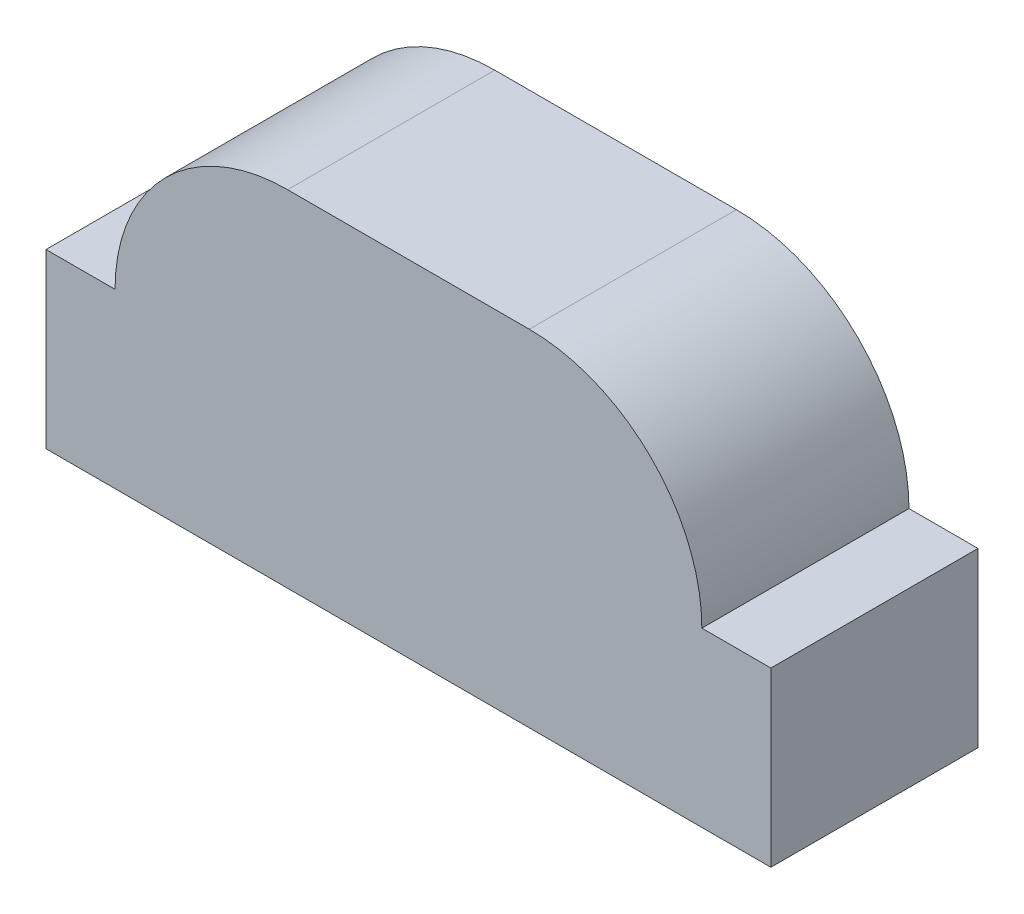
ISO-10303-21;
HEADER;
FILE_DESCRIPTION(('STEP AP214'),'2;1');
FILE_NAME('part.step','',(''),(''),'','','');
FILE_SCHEMA(('AUTOMOTIVE_DESIGN { 1 0 10303 214 1 1 1 1 }'));
ENDSEC;
DATA;
#1=APPLICATION_CONTEXT('core data for automotive mechanical design processes');
#2=APPLICATION_PROTOCOL_DEFINITION('international standard','automotive_design',2000,#1);
#3=PRODUCT_CONTEXT('',#1,'mechanical');
#4=PRODUCT('Part','Part','',(#3));
#5=PRODUCT_RELATED_PRODUCT_CATEGORY('part','',(#4));
#6=PRODUCT_DEFINITION_FORMATION('','',#4);
#7=PRODUCT_DEFINITION_CONTEXT('part definition',#1,'design');
#8=PRODUCT_DEFINITION('design','',#6,#7);
#9=PRODUCT_DEFINITION_SHAPE('','',#8);
#10=(LENGTH_UNIT() NAMED_UNIT(*) SI_UNIT(.MILLI.,.METRE.));
#11=(NAMED_UNIT(*) PLANE_ANGLE_UNIT() SI_UNIT($,.RADIAN.));
#12=(NAMED_UNIT(*) SI_UNIT($,.STERADIAN.) SOLID_ANGLE_UNIT());
#13=UNCERTAINTY_MEASURE_WITH_UNIT(LENGTH_MEASURE(1.E-05),#10,'distance_accuracy_value','');
#14=(GEOMETRIC_REPRESENTATION_CONTEXT(3) GLOBAL_UNCERTAINTY_ASSIGNED_CONTEXT((#13)) GLOBAL_UNIT_ASSIGNED_CONTEXT((#10,
#11,#12)) REPRESENTATION_CONTEXT('',''));
#15=CARTESIAN_POINT('',(0.,0.,0.));
#16=DIRECTION('',(0.,0.,1.));
#17=DIRECTION('',(1.,0.,0.));
#18=AXIS2_PLACEMENT_3D('',#15,#16,#17);
#19=CARTESIAN_POINT('',(-1.05,0.5,-0.299999999999995));
#20=DIRECTION('',(0.,0.,1.));
#21=DIRECTION('',(1.,0.,0.));
#22=AXIS2_PLACEMENT_3D('',#19,#20,#21);
#23=PLANE('',#22);
#24=CARTESIAN_POINT('',(-0.35,0.5,-0.299999999999995));
#25=DIRECTION('',(0.,0.,1.));
#26=DIRECTION('',(1.,0.,0.));
#27=AXIS2_PLACEMENT_3D('',#24,#25,#26);
#28=CIRCLE('',#27,0.5);
#29=CARTESIAN_POINT('',(-0.35,1.,-0.299999999999995));
#30=VERTEX_POINT('',#29);
#31=CARTESIAN_POINT('',(-0.85,0.5,-0.299999999999995));
#32=VERTEX_POINT('',#31);
#33=EDGE_CURVE('E20',#30,#32,#28,.T.);
#34=ORIENTED_EDGE('',*,*,#33,.F.);
#35=DIRECTION('',(1.,0.,0.));
#36=VECTOR('',#35,1.);
#37=CARTESIAN_POINT('',(-1.05,1.,-0.299999999999995));
#38=LINE('',#37,#36);
#39=CARTESIAN_POINT('',(0.35,1.,-0.299999999999995));
#40=VERTEX_POINT('',#39);
#41=EDGE_CURVE('E149',#40,#30,#38,.F.);
#42=ORIENTED_EDGE('',*,*,#41,.F.);
#43=CARTESIAN_POINT('',(0.35,0.5,-0.299999999999995));
#44=DIRECTION('',(0.,0.,-1.));
#45=DIRECTION('',(-1.,0.,0.));
#46=AXIS2_PLACEMENT_3D('',#43,#44,#45);
#47=CIRCLE('',#46,0.5);
#48=CARTESIAN_POINT('',(0.85,0.5,-0.299999999999995));
#49=VERTEX_POINT('',#48);
#50=EDGE_CURVE('E146',#49,#40,#47,.F.);
#51=ORIENTED_EDGE('',*,*,#50,.F.);
#52=DIRECTION('',(1.,0.,0.));
#53=VECTOR('',#52,1.);
#54=CARTESIAN_POINT('',(0.,0.5,-0.299999999999995));
#55=LINE('',#54,#53);
#56=CARTESIAN_POINT('',(1.05,0.5,-0.299999999999995));
#57=VERTEX_POINT('',#56);
#58=EDGE_CURVE('E140',#49,#57,#55,.T.);
#59=ORIENTED_EDGE('',*,*,#58,.T.);
#60=DIRECTION('',(0.,1.,0.));
#61=VECTOR('',#60,1.);
#62=CARTESIAN_POINT('',(1.05,0.5,-0.299999999999995));
#63=LINE('',#62,#61);
#64=CARTESIAN_POINT('',(1.05,0.,-0.299999999999995));
#65=VERTEX_POINT('',#64);
#66=EDGE_CURVE('E124',#57,#65,#63,.F.);
#67=ORIENTED_EDGE('',*,*,#66,.T.);
#68=DIRECTION('',(1.,0.,0.));
#69=VECTOR('',#68,1.);
#70=CARTESIAN_POINT('',(0.,0.,-0.299999999999995));
#71=LINE('',#70,#69);
#72=CARTESIAN_POINT('',(-1.05,0.,-0.299999999999995));
#73=VERTEX_POINT('',#72);
#74=EDGE_CURVE('E117',#73,#65,#71,.T.);
#75=ORIENTED_EDGE('',*,*,#74,.F.);
#76=DIRECTION('',(0.,1.,0.));
#77=VECTOR('',#76,1.);
#78=CARTESIAN_POINT('',(-1.05,0.5,-0.299999999999995));
#79=LINE('',#78,#77);
#80=CARTESIAN_POINT('',(-1.05,0.5,-0.299999999999995));
#81=VERTEX_POINT('',#80);
#82=EDGE_CURVE('E64',#81,#73,#79,.F.);
#83=ORIENTED_EDGE('',*,*,#82,.F.);
#84=DIRECTION('',(1.,0.,0.));
#85=VECTOR('',#84,1.);
#86=CARTESIAN_POINT('',(-1.05,0.5,-0.299999999999995));
#87=LINE('',#86,#85);
#88=EDGE_CURVE('E90',#32,#81,#87,.F.);
#89=ORIENTED_EDGE('',*,*,#88,.F.);
#90=EDGE_LOOP('',(#34,#42,#51,#59,#67,#75,#83,#89));
#91=FACE_BOUND('',#90,.T.);
#92=ADVANCED_FACE('F17',(#91),#23,.F.);
#93=CARTESIAN_POINT('',(0.35,0.5,0.));
#94=DIRECTION('',(0.,0.,-1.));
#95=DIRECTION('',(-1.,0.,0.));
#96=AXIS2_PLACEMENT_3D('',#93,#94,#95);
#97=CYLINDRICAL_SURFACE('',#96,0.5);
#98=ORIENTED_EDGE('',*,*,#50,.T.);
#99=DIRECTION('',(0.,0.,-1.));
#100=VECTOR('',#99,1.);
#101=CARTESIAN_POINT('',(0.35,1.,0.));
#102=LINE('',#101,#100);
#103=CARTESIAN_POINT('',(0.35,1.,0.299999999999995));
#104=VERTEX_POINT('',#103);
#105=EDGE_CURVE('E169',#40,#104,#102,.F.);
#106=ORIENTED_EDGE('',*,*,#105,.T.);
#107=CARTESIAN_POINT('',(0.35,0.5,0.299999999999995));
#108=DIRECTION('',(0.,0.,-1.));
#109=DIRECTION('',(-1.,0.,0.));
#110=AXIS2_PLACEMENT_3D('',#107,#108,#109);
#111=CIRCLE('',#110,0.5);
#112=CARTESIAN_POINT('',(0.85,0.5,0.299999999999995));
#113=VERTEX_POINT('',#112);
#114=EDGE_CURVE('E161',#104,#113,#111,.T.);
#115=ORIENTED_EDGE('',*,*,#114,.T.);
#116=DIRECTION('',(0.,0.,-1.));
#117=VECTOR('',#116,1.);
#118=CARTESIAN_POINT('',(0.85,0.5,0.));
#119=LINE('',#118,#117);
#120=EDGE_CURVE('E135',#113,#49,#119,.T.);
#121=ORIENTED_EDGE('',*,*,#120,.T.);
#122=EDGE_LOOP('',(#98,#106,#115,#121));
#123=FACE_BOUND('',#122,.T.);
#124=ADVANCED_FACE('F168',(#123),#97,.T.);
#125=CARTESIAN_POINT('',(0.,0.5,0.));
#126=DIRECTION('',(0.,-1.,0.));
#127=DIRECTION('',(0.,0.,-1.));
#128=AXIS2_PLACEMENT_3D('',#125,#126,#127);
#129=PLANE('',#128);
#130=DIRECTION('',(-1.,0.,0.));
#131=VECTOR('',#130,1.);
#132=CARTESIAN_POINT('',(-1.05,0.5,0.299999999999995));
#133=LINE('',#132,#131);
#134=CARTESIAN_POINT('',(1.05,0.5,0.299999999999995));
#135=VERTEX_POINT('',#134);
#136=EDGE_CURVE('E129',#113,#135,#133,.F.);
#137=ORIENTED_EDGE('',*,*,#136,.T.);
#138=DIRECTION('',(0.,0.,1.));
#139=VECTOR('',#138,1.);
#140=CARTESIAN_POINT('',(1.05,0.5,0.299999999999995));
#141=LINE('',#140,#139);
#142=EDGE_CURVE('E132',#135,#57,#141,.F.);
#143=ORIENTED_EDGE('',*,*,#142,.T.);
#144=ORIENTED_EDGE('',*,*,#58,.F.);
#145=ORIENTED_EDGE('',*,*,#120,.F.);
#146=EDGE_LOOP('',(#137,#143,#144,#145));
#147=FACE_BOUND('',#146,.T.);
#148=ADVANCED_FACE('F182',(#147),#129,.F.);
#149=CARTESIAN_POINT('',(1.05,0.5,0.299999999999995));
#150=DIRECTION('',(-1.,0.,0.));
#151=DIRECTION('',(0.,0.,1.));
#152=AXIS2_PLACEMENT_3D('',#149,#150,#151);
#153=PLANE('',#152);
#154=ORIENTED_EDGE('',*,*,#66,.F.);
#155=ORIENTED_EDGE('',*,*,#142,.F.);
#156=DIRECTION('',(0.,1.,0.));
#157=VECTOR('',#156,1.);
#158=CARTESIAN_POINT('',(1.05,0.5,0.299999999999995));
#159=LINE('',#158,#157);
#160=CARTESIAN_POINT('',(1.05,0.,0.299999999999995));
#161=VERTEX_POINT('',#160);
#162=EDGE_CURVE('E109',#135,#161,#159,.F.);
#163=ORIENTED_EDGE('',*,*,#162,.T.);
#164=DIRECTION('',(0.,0.,-1.));
#165=VECTOR('',#164,1.);
#166=CARTESIAN_POINT('',(1.05,0.,0.));
#167=LINE('',#166,#165);
#168=EDGE_CURVE('E122',#65,#161,#167,.F.);
#169=ORIENTED_EDGE('',*,*,#168,.F.);
#170=EDGE_LOOP('',(#154,#155,#163,#169));
#171=FACE_BOUND('',#170,.T.);
#172=ADVANCED_FACE('F187',(#171),#153,.F.);
#173=CARTESIAN_POINT('',(0.,0.,0.));
#174=DIRECTION('',(0.,-1.,0.));
#175=DIRECTION('',(0.,0.,-1.));
#176=AXIS2_PLACEMENT_3D('',#173,#174,#175);
#177=PLANE('',#176);
#178=DIRECTION('',(0.,0.,-1.));
#179=VECTOR('',#178,1.);
#180=CARTESIAN_POINT('',(-1.05,0.,0.299999999999995));
#181=LINE('',#180,#179);
#182=CARTESIAN_POINT('',(-1.05,0.,0.299999999999995));
#183=VERTEX_POINT('',#182);
#184=EDGE_CURVE('E94',#183,#73,#181,.T.);
#185=ORIENTED_EDGE('',*,*,#184,.T.);
#186=ORIENTED_EDGE('',*,*,#74,.T.);
#187=ORIENTED_EDGE('',*,*,#168,.T.);
#188=DIRECTION('',(-1.,0.,0.));
#189=VECTOR('',#188,1.);
#190=CARTESIAN_POINT('',(-1.05,0.,0.299999999999995));
#191=LINE('',#190,#189);
#192=EDGE_CURVE('E107',#161,#183,#191,.T.);
#193=ORIENTED_EDGE('',*,*,#192,.T.);
#194=EDGE_LOOP('',(#185,#186,#187,#193));
#195=FACE_BOUND('',#194,.T.);
#196=ADVANCED_FACE('F189',(#195),#177,.T.);
#197=CARTESIAN_POINT('',(-1.05,0.5,0.299999999999995));
#198=DIRECTION('',(1.,0.,0.));
#199=DIRECTION('',(0.,0.,-1.));
#200=AXIS2_PLACEMENT_3D('',#197,#198,#199);
#201=PLANE('',#200);
#202=DIRECTION('',(0.,1.,0.));
#203=VECTOR('',#202,1.);
#204=CARTESIAN_POINT('',(-1.05,0.5,0.299999999999995));
#205=LINE('',#204,#203);
#206=CARTESIAN_POINT('',(-1.05,0.5,0.299999999999995));
#207=VERTEX_POINT('',#206);
#208=EDGE_CURVE('E101',#183,#207,#205,.T.);
#209=ORIENTED_EDGE('',*,*,#208,.T.);
#210=DIRECTION('',(0.,0.,-1.));
#211=VECTOR('',#210,1.);
#212=CARTESIAN_POINT('',(-1.05,0.5,0.));
#213=LINE('',#212,#211);
#214=EDGE_CURVE('E85',#207,#81,#213,.T.);
#215=ORIENTED_EDGE('',*,*,#214,.T.);
#216=ORIENTED_EDGE('',*,*,#82,.T.);
#217=ORIENTED_EDGE('',*,*,#184,.F.);
#218=EDGE_LOOP('',(#209,#215,#216,#217));
#219=FACE_BOUND('',#218,.T.);
#220=ADVANCED_FACE('F105',(#219),#201,.F.);
#221=CARTESIAN_POINT('',(0.,0.5,0.));
#222=DIRECTION('',(0.,-1.,0.));
#223=DIRECTION('',(0.,0.,-1.));
#224=AXIS2_PLACEMENT_3D('',#221,#222,#223);
#225=PLANE('',#224);
#226=ORIENTED_EDGE('',*,*,#88,.T.);
#227=ORIENTED_EDGE('',*,*,#214,.F.);
#228=DIRECTION('',(-1.,0.,0.));
#229=VECTOR('',#228,1.);
#230=CARTESIAN_POINT('',(-1.05,0.5,0.299999999999995));
#231=LINE('',#230,#229);
#232=CARTESIAN_POINT('',(-0.85,0.5,0.299999999999995));
#233=VERTEX_POINT('',#232);
#234=EDGE_CURVE('E89',#207,#233,#231,.F.);
#235=ORIENTED_EDGE('',*,*,#234,.T.);
#236=DIRECTION('',(0.,0.,1.));
#237=VECTOR('',#236,1.);
#238=CARTESIAN_POINT('',(-0.85,0.500000000000001,0.));
#239=LINE('',#238,#237);
#240=EDGE_CURVE('E93',#32,#233,#239,.T.);
#241=ORIENTED_EDGE('',*,*,#240,.F.);
#242=EDGE_LOOP('',(#226,#227,#235,#241));
#243=FACE_BOUND('',#242,.T.);
#244=ADVANCED_FACE('F87',(#243),#225,.F.);
#245=CARTESIAN_POINT('',(-0.35,0.5,0.));
#246=DIRECTION('',(0.,0.,1.));
#247=DIRECTION('',(1.,0.,0.));
#248=AXIS2_PLACEMENT_3D('',#245,#246,#247);
#249=CYLINDRICAL_SURFACE('',#248,0.5);
#250=CARTESIAN_POINT('',(-0.35,0.5,0.299999999999995));
#251=DIRECTION('',(0.,0.,1.));
#252=DIRECTION('',(1.,0.,0.));
#253=AXIS2_PLACEMENT_3D('',#250,#251,#252);
#254=CIRCLE('',#253,0.5);
#255=CARTESIAN_POINT('',(-0.35,1.,0.299999999999995));
#256=VERTEX_POINT('',#255);
#257=EDGE_CURVE('E26',#233,#256,#254,.F.);
#258=ORIENTED_EDGE('',*,*,#257,.T.);
#259=DIRECTION('',(0.,0.,-1.));
#260=VECTOR('',#259,1.);
#261=CARTESIAN_POINT('',(-0.35,1.,0.));
#262=LINE('',#261,#260);
#263=EDGE_CURVE('E34',#256,#30,#262,.T.);
#264=ORIENTED_EDGE('',*,*,#263,.T.);
#265=ORIENTED_EDGE('',*,*,#33,.T.);
#266=ORIENTED_EDGE('',*,*,#240,.T.);
#267=EDGE_LOOP('',(#258,#264,#265,#266));
#268=FACE_BOUND('',#267,.T.);
#269=ADVANCED_FACE('F204',(#268),#249,.T.);
#270=CARTESIAN_POINT('',(0.,1.,0.));
#271=DIRECTION('',(0.,-1.,0.));
#272=DIRECTION('',(0.,0.,-1.));
#273=AXIS2_PLACEMENT_3D('',#270,#271,#272);
#274=PLANE('',#273);
#275=ORIENTED_EDGE('',*,*,#263,.F.);
#276=DIRECTION('',(-1.,0.,0.));
#277=VECTOR('',#276,1.);
#278=CARTESIAN_POINT('',(-1.05,1.,0.299999999999995));
#279=LINE('',#278,#277);
#280=EDGE_CURVE('E11',#256,#104,#279,.F.);
#281=ORIENTED_EDGE('',*,*,#280,.T.);
#282=ORIENTED_EDGE('',*,*,#105,.F.);
#283=ORIENTED_EDGE('',*,*,#41,.T.);
#284=EDGE_LOOP('',(#275,#281,#282,#283));
#285=FACE_BOUND('',#284,.T.);
#286=ADVANCED_FACE('F170',(#285),#274,.F.);
#287=CARTESIAN_POINT('',(-1.05,0.5,0.299999999999995));
#288=DIRECTION('',(0.,0.,-1.));
#289=DIRECTION('',(-1.,0.,0.));
#290=AXIS2_PLACEMENT_3D('',#287,#288,#289);
#291=PLANE('',#290);
#292=ORIENTED_EDGE('',*,*,#257,.F.);
#293=ORIENTED_EDGE('',*,*,#234,.F.);
#294=ORIENTED_EDGE('',*,*,#208,.F.);
#295=ORIENTED_EDGE('',*,*,#192,.F.);
#296=ORIENTED_EDGE('',*,*,#162,.F.);
#297=ORIENTED_EDGE('',*,*,#136,.F.);
#298=ORIENTED_EDGE('',*,*,#114,.F.);
#299=ORIENTED_EDGE('',*,*,#280,.F.);
#300=EDGE_LOOP('',(#292,#293,#294,#295,#296,#297,#298,#299));
#301=FACE_BOUND('',#300,.T.);
#302=ADVANCED_FACE('F99',(#301),#291,.F.);
#303=CLOSED_SHELL('',(#92,#124,#148,#172,#196,#220,#244,#269,#286,#302));
#304=MANIFOLD_SOLID_BREP('B1',#303);
#305=ADVANCED_BREP_SHAPE_REPRESENTATION('',(#18,#304),#14);
#306=SHAPE_DEFINITION_REPRESENTATION(#9,#305);
ENDSEC;
END-ISO-10303-21;
